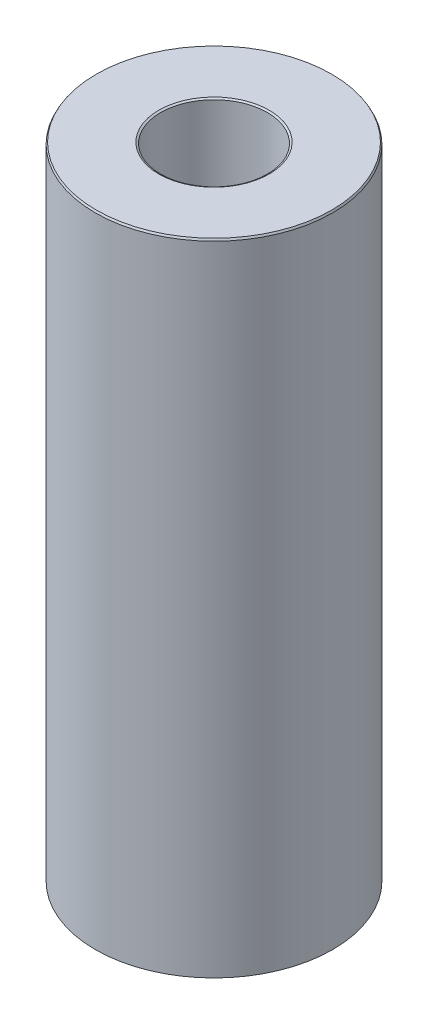
ISO-10303-21;
HEADER;
FILE_DESCRIPTION(('STEP AP214'),'2;1');
FILE_NAME('part.step','',(''),(''),'','','');
FILE_SCHEMA(('AUTOMOTIVE_DESIGN { 1 0 10303 214 1 1 1 1 }'));
ENDSEC;
DATA;
#1=APPLICATION_CONTEXT('core data for automotive mechanical design processes');
#2=APPLICATION_PROTOCOL_DEFINITION('international standard','automotive_design',2000,#1);
#3=PRODUCT_CONTEXT('',#1,'mechanical');
#4=PRODUCT('Part','Part','',(#3));
#5=PRODUCT_RELATED_PRODUCT_CATEGORY('part','',(#4));
#6=PRODUCT_DEFINITION_FORMATION('','',#4);
#7=PRODUCT_DEFINITION_CONTEXT('part definition',#1,'design');
#8=PRODUCT_DEFINITION('design','',#6,#7);
#9=PRODUCT_DEFINITION_SHAPE('','',#8);
#10=(LENGTH_UNIT() NAMED_UNIT(*) SI_UNIT(.MILLI.,.METRE.));
#11=(NAMED_UNIT(*) PLANE_ANGLE_UNIT() SI_UNIT($,.RADIAN.));
#12=(NAMED_UNIT(*) SI_UNIT($,.STERADIAN.) SOLID_ANGLE_UNIT());
#13=UNCERTAINTY_MEASURE_WITH_UNIT(LENGTH_MEASURE(1.E-05),#10,'distance_accuracy_value','');
#14=(GEOMETRIC_REPRESENTATION_CONTEXT(3) GLOBAL_UNCERTAINTY_ASSIGNED_CONTEXT((#13)) GLOBAL_UNIT_ASSIGNED_CONTEXT((#10,
#11,#12)) REPRESENTATION_CONTEXT('',''));
#15=CARTESIAN_POINT('',(0.,0.,0.));
#16=DIRECTION('',(0.,0.,1.));
#17=DIRECTION('',(1.,0.,0.));
#18=AXIS2_PLACEMENT_3D('',#15,#16,#17);
#19=CARTESIAN_POINT('',(0.,161.933538741757,0.));
#20=DIRECTION('',(0.,-1.,0.));
#21=DIRECTION('',(0.,0.,-1.));
#22=AXIS2_PLACEMENT_3D('',#19,#20,#21);
#23=CYLINDRICAL_SURFACE('',#22,30.);
#24=CARTESIAN_POINT('',(0.,0.259017484896457,0.));
#25=DIRECTION('',(0.,1.,0.));
#26=DIRECTION('',(0.,0.,1.));
#27=AXIS2_PLACEMENT_3D('',#24,#25,#26);
#28=CIRCLE('',#27,30.);
#29=CARTESIAN_POINT('',(0.,0.259017484896457,30.));
#30=VERTEX_POINT('',#29);
#31=EDGE_CURVE('E10',#30,#30,#28,.T.);
#32=ORIENTED_EDGE('',*,*,#31,.T.);
#33=EDGE_LOOP('',(#32));
#34=FACE_BOUND('',#33,.T.);
#35=CARTESIAN_POINT('',(0.,161.460937771824,0.));
#36=DIRECTION('',(0.,1.,0.));
#37=DIRECTION('',(0.,0.,1.));
#38=AXIS2_PLACEMENT_3D('',#35,#36,#37);
#39=CIRCLE('',#38,30.);
#40=CARTESIAN_POINT('',(0.,161.460937771824,-30.));
#41=VERTEX_POINT('',#40);
#42=EDGE_CURVE('E50',#41,#41,#39,.F.);
#43=ORIENTED_EDGE('',*,*,#42,.T.);
#44=EDGE_LOOP('',(#43));
#45=FACE_BOUND('',#44,.T.);
#46=ADVANCED_FACE('F39',(#34,#45),#23,.T.);
#47=CARTESIAN_POINT('',(0.,161.933538741757,0.));
#48=DIRECTION('',(0.,1.,0.));
#49=DIRECTION('',(0.,0.,1.));
#50=AXIS2_PLACEMENT_3D('',#47,#48,#49);
#51=PLANE('',#50);
#52=CARTESIAN_POINT('',(0.,161.933538741757,0.));
#53=DIRECTION('',(0.,1.,0.));
#54=DIRECTION('',(0.,0.,1.));
#55=AXIS2_PLACEMENT_3D('',#52,#53,#54);
#56=CIRCLE('',#55,13.9594570714515);
#57=CARTESIAN_POINT('',(0.,161.933538741757,13.9594570714515));
#58=VERTEX_POINT('',#57);
#59=EDGE_CURVE('E58',#58,#58,#56,.F.);
#60=ORIENTED_EDGE('',*,*,#59,.T.);
#61=EDGE_LOOP('',(#60));
#62=FACE_BOUND('',#61,.T.);
#63=CARTESIAN_POINT('',(0.,161.933538741757,0.));
#64=DIRECTION('',(0.,1.,0.));
#65=DIRECTION('',(0.,0.,1.));
#66=AXIS2_PLACEMENT_3D('',#63,#64,#65);
#67=CIRCLE('',#66,29.7409825151036);
#68=CARTESIAN_POINT('',(0.,161.933538741757,-29.7409825151036));
#69=VERTEX_POINT('',#68);
#70=EDGE_CURVE('E61',#69,#69,#67,.T.);
#71=ORIENTED_EDGE('',*,*,#70,.T.);
#72=EDGE_LOOP('',(#71));
#73=FACE_BOUND('',#72,.T.);
#74=ADVANCED_FACE('F88',(#62,#73),#51,.T.);
#75=CARTESIAN_POINT('',(0.,0.,0.));
#76=DIRECTION('',(0.,1.,0.));
#77=DIRECTION('',(0.,0.,1.));
#78=AXIS2_PLACEMENT_3D('',#75,#76,#77);
#79=PLANE('',#78);
#80=CARTESIAN_POINT('',(0.,0.,0.));
#81=DIRECTION('',(0.,1.,0.));
#82=DIRECTION('',(0.,0.,1.));
#83=AXIS2_PLACEMENT_3D('',#80,#81,#82);
#84=CIRCLE('',#83,13.7458735864146);
#85=CARTESIAN_POINT('',(0.,0.,-13.7458735864146));
#86=VERTEX_POINT('',#85);
#87=EDGE_CURVE('E51',#86,#86,#84,.T.);
#88=ORIENTED_EDGE('',*,*,#87,.T.);
#89=EDGE_LOOP('',(#88));
#90=FACE_BOUND('',#89,.T.);
#91=CARTESIAN_POINT('',(0.,0.,0.));
#92=DIRECTION('',(0.,1.,0.));
#93=DIRECTION('',(0.,0.,1.));
#94=AXIS2_PLACEMENT_3D('',#91,#92,#93);
#95=CIRCLE('',#94,29.5273990300666);
#96=CARTESIAN_POINT('',(0.,0.,29.5273990300666));
#97=VERTEX_POINT('',#96);
#98=EDGE_CURVE('E54',#97,#97,#95,.F.);
#99=ORIENTED_EDGE('',*,*,#98,.T.);
#100=EDGE_LOOP('',(#99));
#101=FACE_BOUND('',#100,.T.);
#102=ADVANCED_FACE('F83',(#90,#101),#79,.F.);
#103=CARTESIAN_POINT('',(0.,161.933538741757,0.));
#104=DIRECTION('',(0.,-1.,0.));
#105=DIRECTION('',(0.,0.,-1.));
#106=AXIS2_PLACEMENT_3D('',#103,#104,#105);
#107=CYLINDRICAL_SURFACE('',#106,13.4868561015181);
#108=CARTESIAN_POINT('',(0.,161.67452125686,0.));
#109=DIRECTION('',(0.,1.,0.));
#110=DIRECTION('',(0.,0.,1.));
#111=AXIS2_PLACEMENT_3D('',#108,#109,#110);
#112=CIRCLE('',#111,13.4868561015181);
#113=CARTESIAN_POINT('',(0.,161.67452125686,13.4868561015181));
#114=VERTEX_POINT('',#113);
#115=EDGE_CURVE('E67',#114,#114,#112,.T.);
#116=ORIENTED_EDGE('',*,*,#115,.T.);
#117=EDGE_LOOP('',(#116));
#118=FACE_BOUND('',#117,.T.);
#119=CARTESIAN_POINT('',(0.,0.472600969933429,0.));
#120=DIRECTION('',(0.,1.,0.));
#121=DIRECTION('',(0.,0.,1.));
#122=AXIS2_PLACEMENT_3D('',#119,#120,#121);
#123=CIRCLE('',#122,13.4868561015181);
#124=CARTESIAN_POINT('',(0.,0.472600969933429,-13.4868561015181));
#125=VERTEX_POINT('',#124);
#126=EDGE_CURVE('E69',#125,#125,#123,.F.);
#127=ORIENTED_EDGE('',*,*,#126,.T.);
#128=EDGE_LOOP('',(#127));
#129=FACE_BOUND('',#128,.T.);
#130=ADVANCED_FACE('F71',(#118,#129),#107,.F.);
#131=CARTESIAN_POINT('',(0.,161.67452125686,0.));
#132=DIRECTION('',(0.,1.,0.));
#133=DIRECTION('',(0.,0.,1.));
#134=AXIS2_PLACEMENT_3D('',#131,#132,#133);
#135=CONICAL_SURFACE('',#134,13.4868561015181,1.06943760034883);
#136=ORIENTED_EDGE('',*,*,#59,.F.);
#137=EDGE_LOOP('',(#136));
#138=FACE_BOUND('',#137,.T.);
#139=ORIENTED_EDGE('',*,*,#115,.F.);
#140=EDGE_LOOP('',(#139));
#141=FACE_BOUND('',#140,.T.);
#142=ADVANCED_FACE('F77',(#138,#141),#135,.F.);
#143=CARTESIAN_POINT('',(0.,0.,0.));
#144=DIRECTION('',(0.,-1.,0.));
#145=DIRECTION('',(0.,0.,-1.));
#146=AXIS2_PLACEMENT_3D('',#143,#144,#145);
#147=CONICAL_SURFACE('',#146,13.7458735864146,0.501358726446042);
#148=CARTESIAN_POINT('',(0.,0.472600969933429,-13.4868561015181));
#149=CARTESIAN_POINT('',(0.,0.467678043163289,-13.4895542003191));
#150=CARTESIAN_POINT('',(0.,0.462755116393149,-13.4922522991201));
#151=CARTESIAN_POINT('',(0.,0.452909262852869,-13.4976484967222));
#152=CARTESIAN_POINT('',(0.,0.447986336082729,-13.5003465955232));
#153=CARTESIAN_POINT('',(0.,0.438140482542449,-13.5057427931252));
#154=CARTESIAN_POINT('',(0.,0.43321755577231,-13.5084408919262));
#155=CARTESIAN_POINT('',(0.,0.42337170223203,-13.5138370895282));
#156=CARTESIAN_POINT('',(0.,0.41844877546189,-13.5165351883292));
#157=CARTESIAN_POINT('',(0.,0.40860292192161,-13.5219313859312));
#158=CARTESIAN_POINT('',(0.,0.40367999515147,-13.5246294847322));
#159=CARTESIAN_POINT('',(0.,0.39383414161119,-13.5300256823342));
#160=CARTESIAN_POINT('',(0.,0.388911214841051,-13.5327237811352));
#161=CARTESIAN_POINT('',(0.,0.379065361300771,-13.5381199787372));
#162=CARTESIAN_POINT('',(0.,0.374142434530631,-13.5408180775382));
#163=CARTESIAN_POINT('',(0.,0.364296580990351,-13.5462142751402));
#164=CARTESIAN_POINT('',(0.,0.359373654220212,-13.5489123739412));
#165=CARTESIAN_POINT('',(0.,0.349527800679932,-13.5543085715433));
#166=CARTESIAN_POINT('',(0.,0.344604873909792,-13.5570066703443));
#167=CARTESIAN_POINT('',(0.,0.334759020369512,-13.5624028679463));
#168=CARTESIAN_POINT('',(0.,0.329836093599372,-13.5651009667473));
#169=CARTESIAN_POINT('',(0.,0.319990240059092,-13.5704971643493));
#170=CARTESIAN_POINT('',(0.,0.315067313288953,-13.5731952631503));
#171=CARTESIAN_POINT('',(0.,0.305221459748673,-13.5785914607523));
#172=CARTESIAN_POINT('',(0.,0.300298532978533,-13.5812895595533));
#173=CARTESIAN_POINT('',(0.,0.290452679438253,-13.5866857571553));
#174=CARTESIAN_POINT('',(0.,0.285529752668113,-13.5893838559563));
#175=CARTESIAN_POINT('',(0.,0.275683899127833,-13.5947800535583));
#176=CARTESIAN_POINT('',(0.,0.270760972357694,-13.5974781523593));
#177=CARTESIAN_POINT('',(0.,0.260915118817414,-13.6028743499613));
#178=CARTESIAN_POINT('',(0.,0.255992192047274,-13.6055724487624));
#179=CARTESIAN_POINT('',(0.,0.246146338506994,-13.6109686463644));
#180=CARTESIAN_POINT('',(0.,0.241223411736854,-13.6136667451654));
#181=CARTESIAN_POINT('',(0.,0.231377558196575,-13.6190629427674));
#182=CARTESIAN_POINT('',(0.,0.226454631426435,-13.6217610415684));
#183=CARTESIAN_POINT('',(0.,0.216608777886155,-13.6271572391704));
#184=CARTESIAN_POINT('',(0.,0.211685851116015,-13.6298553379714));
#185=CARTESIAN_POINT('',(0.,0.201839997575735,-13.6352515355734));
#186=CARTESIAN_POINT('',(0.,0.196917070805595,-13.6379496343744));
#187=CARTESIAN_POINT('',(0.,0.187071217265316,-13.6433458319764));
#188=CARTESIAN_POINT('',(0.,0.182148290495176,-13.6460439307774));
#189=CARTESIAN_POINT('',(0.,0.172302436954896,-13.6514401283794));
#190=CARTESIAN_POINT('',(0.,0.167379510184756,-13.6541382271804));
#191=CARTESIAN_POINT('',(0.,0.157533656644476,-13.6595344247824));
#192=CARTESIAN_POINT('',(0.,0.152610729874336,-13.6622325235835));
#193=CARTESIAN_POINT('',(0.,0.142764876334057,-13.6676287211855));
#194=CARTESIAN_POINT('',(0.,0.137841949563917,-13.6703268199865));
#195=CARTESIAN_POINT('',(0.,0.127996096023637,-13.6757230175885));
#196=CARTESIAN_POINT('',(0.,0.123073169253497,-13.6784211163895));
#197=CARTESIAN_POINT('',(0.,0.113227315713217,-13.6838173139915));
#198=CARTESIAN_POINT('',(0.,0.108304388943077,-13.6865154127925));
#199=CARTESIAN_POINT('',(0.,0.0984585354027977,-13.6919116103945));
#200=CARTESIAN_POINT('',(0.,0.0935356086326578,-13.6946097091955));
#201=CARTESIAN_POINT('',(0.,0.083689755092378,-13.7000059067975));
#202=CARTESIAN_POINT('',(0.,0.0787668283222383,-13.7027040055985));
#203=CARTESIAN_POINT('',(0.,0.0689209747819585,-13.7081002032005));
#204=CARTESIAN_POINT('',(0.,0.0639980480118184,-13.7107983020015));
#205=CARTESIAN_POINT('',(0.,0.0541521944715386,-13.7161944996035));
#206=CARTESIAN_POINT('',(0.,0.0492292677013988,-13.7188925984046));
#207=CARTESIAN_POINT('',(0.,0.0393834141611191,-13.7242887960066));
#208=CARTESIAN_POINT('',(0.,0.0344604873909793,-13.7269868948076));
#209=CARTESIAN_POINT('',(0.,0.0246146338506995,-13.7323830924096));
#210=CARTESIAN_POINT('',(0.,0.0196917070805595,-13.7350811912106));
#211=CARTESIAN_POINT('',(0.,0.00984585354027953,-13.7404773888126));
#212=CARTESIAN_POINT('',(0.,0.00492292677013953,-13.7431754876136));
#213=CARTESIAN_POINT('',(0.,0.,-13.7458735864146));
#214=B_SPLINE_CURVE_WITH_KNOTS('',3,(#148,#149,#150,#151,#152,#153,#154,#155,#156,#157,#158,
#159,#160,#161,#162,#163,#164,#165,#166,#167,#168,#169,#170,#171,#172,#173,#174,#175,#176,#177,
#178,#179,#180,#181,#182,#183,#184,#185,#186,#187,#188,#189,#190,#191,#192,#193,#194,#195,#196,
#197,#198,#199,#200,#201,#202,#203,#204,#205,#206,#207,#208,#209,#210,#211,#212,#213),
.UNSPECIFIED.,.F.,.F.,(4,2,2,2,2,2,2,2,2,2,2,2,2,2,2,2,2,2,2,2,2,2,2,2,2,2,2,2,2,2,2,2,4),(0.,
0.0168414520192679,0.033682904038535,0.0505243560578029,0.0673658080770708,0.0842072600963378,
0.101048712115606,0.117890164134874,0.134731616154142,0.151573068173409,0.168414520192677,
0.185255972211944,0.202097424231212,0.218938876250479,0.235780328269747,0.252621780289014,
0.269463232308282,0.28630468432755,0.303146136346817,0.319987588366085,0.336829040385353,
0.35367049240462,0.370511944423888,0.387353396443156,0.404194848462423,0.421036300481691,
0.437877752500959,0.454719204520227,0.471560656539494,0.488402108558762,0.50524356057803,
0.522085012597297,0.538926464616565),.UNSPECIFIED.);
#215=EDGE_CURVE('BSEAM73',#125,#86,#214,.T.);
#216=ORIENTED_EDGE('',*,*,#126,.F.);
#217=ORIENTED_EDGE('',*,*,#87,.F.);
#218=ORIENTED_EDGE('',*,*,#215,.T.);
#219=ORIENTED_EDGE('',*,*,#215,.F.);
#220=EDGE_LOOP('',(#216,#218,#217,#219));
#221=FACE_BOUND('',#220,.T.);
#222=ADVANCED_FACE('F73',(#221),#147,.F.);
#223=CARTESIAN_POINT('',(0.,0.259017484896457,0.));
#224=DIRECTION('',(0.,1.,0.));
#225=DIRECTION('',(0.,0.,1.));
#226=AXIS2_PLACEMENT_3D('',#223,#224,#225);
#227=CONICAL_SURFACE('',#226,30.,1.06943760034885);
#228=ORIENTED_EDGE('',*,*,#98,.F.);
#229=EDGE_LOOP('',(#228));
#230=FACE_BOUND('',#229,.T.);
#231=ORIENTED_EDGE('',*,*,#31,.F.);
#232=EDGE_LOOP('',(#231));
#233=FACE_BOUND('',#232,.T.);
#234=ADVANCED_FACE('F76',(#230,#233),#227,.T.);
#235=CARTESIAN_POINT('',(0.,161.933538741757,0.));
#236=DIRECTION('',(0.,-1.,0.));
#237=DIRECTION('',(0.,0.,-1.));
#238=AXIS2_PLACEMENT_3D('',#235,#236,#237);
#239=CONICAL_SURFACE('',#238,29.7409825151036,0.501358726446054);
#240=CARTESIAN_POINT('',(0.,161.460937771824,-30.));
#241=CARTESIAN_POINT('',(0.,161.465860698594,-29.997301901199));
#242=CARTESIAN_POINT('',(0.,161.470783625364,-29.994603802398));
#243=CARTESIAN_POINT('',(0.,161.480629478904,-29.989207604796));
#244=CARTESIAN_POINT('',(0.,161.485552405674,-29.986509505995));
#245=CARTESIAN_POINT('',(0.,161.495398259215,-29.981113308393));
#246=CARTESIAN_POINT('',(0.,161.500321185985,-29.978415209592));
#247=CARTESIAN_POINT('',(0.,161.510167039525,-29.97301901199));
#248=CARTESIAN_POINT('',(0.,161.515089966295,-29.970320913189));
#249=CARTESIAN_POINT('',(0.,161.524935819835,-29.9649247155869));
#250=CARTESIAN_POINT('',(0.,161.529858746606,-29.9622266167859));
#251=CARTESIAN_POINT('',(0.,161.539704600146,-29.9568304191839));
#252=CARTESIAN_POINT('',(0.,161.544627526916,-29.9541323203829));
#253=CARTESIAN_POINT('',(0.,161.554473380456,-29.9487361227809));
#254=CARTESIAN_POINT('',(0.,161.559396307226,-29.9460380239799));
#255=CARTESIAN_POINT('',(0.,161.569242160767,-29.9406418263779));
#256=CARTESIAN_POINT('',(0.,161.574165087537,-29.9379437275769));
#257=CARTESIAN_POINT('',(0.,161.584010941077,-29.9325475299749));
#258=CARTESIAN_POINT('',(0.,161.588933867847,-29.9298494311739));
#259=CARTESIAN_POINT('',(0.,161.598779721387,-29.9244532335719));
#260=CARTESIAN_POINT('',(0.,161.603702648158,-29.9217551347709));
#261=CARTESIAN_POINT('',(0.,161.613548501698,-29.9163589371689));
#262=CARTESIAN_POINT('',(0.,161.618471428468,-29.9136608383679));
#263=CARTESIAN_POINT('',(0.,161.628317282008,-29.9082646407659));
#264=CARTESIAN_POINT('',(0.,161.633240208778,-29.9055665419649));
#265=CARTESIAN_POINT('',(0.,161.643086062319,-29.9001703443628));
#266=CARTESIAN_POINT('',(0.,161.648008989089,-29.8974722455618));
#267=CARTESIAN_POINT('',(0.,161.657854842629,-29.8920760479598));
#268=CARTESIAN_POINT('',(0.,161.662777769399,-29.8893779491588));
#269=CARTESIAN_POINT('',(0.,161.67262362294,-29.8839817515568));
#270=CARTESIAN_POINT('',(0.,161.67754654971,-29.8812836527558));
#271=CARTESIAN_POINT('',(0.,161.68739240325,-29.8758874551538));
#272=CARTESIAN_POINT('',(0.,161.69231533002,-29.8731893563528));
#273=CARTESIAN_POINT('',(0.,161.70216118356,-29.8677931587508));
#274=CARTESIAN_POINT('',(0.,161.707084110331,-29.8650950599498));
#275=CARTESIAN_POINT('',(0.,161.716929963871,-29.8596988623478));
#276=CARTESIAN_POINT('',(0.,161.721852890641,-29.8570007635468));
#277=CARTESIAN_POINT('',(0.,161.731698744181,-29.8516045659448));
#278=CARTESIAN_POINT('',(0.,161.736621670951,-29.8489064671438));
#279=CARTESIAN_POINT('',(0.,161.746467524492,-29.8435102695417));
#280=CARTESIAN_POINT('',(0.,161.751390451262,-29.8408121707407));
#281=CARTESIAN_POINT('',(0.,161.761236304802,-29.8354159731387));
#282=CARTESIAN_POINT('',(0.,161.766159231572,-29.8327178743377));
#283=CARTESIAN_POINT('',(0.,161.776005085113,-29.8273216767357));
#284=CARTESIAN_POINT('',(0.,161.780928011883,-29.8246235779347));
#285=CARTESIAN_POINT('',(0.,161.790773865423,-29.8192273803327));
#286=CARTESIAN_POINT('',(0.,161.795696792193,-29.8165292815317));
#287=CARTESIAN_POINT('',(0.,161.805542645733,-29.8111330839297));
#288=CARTESIAN_POINT('',(0.,161.810465572503,-29.8084349851287));
#289=CARTESIAN_POINT('',(0.,161.820311426044,-29.8030387875267));
#290=CARTESIAN_POINT('',(0.,161.825234352814,-29.8003406887257));
#291=CARTESIAN_POINT('',(0.,161.835080206354,-29.7949444911237));
#292=CARTESIAN_POINT('',(0.,161.840003133124,-29.7922463923227));
#293=CARTESIAN_POINT('',(0.,161.849848986665,-29.7868501947206));
#294=CARTESIAN_POINT('',(0.,161.854771913435,-29.7841520959196));
#295=CARTESIAN_POINT('',(0.,161.864617766975,-29.7787558983176));
#296=CARTESIAN_POINT('',(0.,161.869540693745,-29.7760577995166));
#297=CARTESIAN_POINT('',(0.,161.879386547285,-29.7706616019146));
#298=CARTESIAN_POINT('',(0.,161.884309474056,-29.7679635031136));
#299=CARTESIAN_POINT('',(0.,161.894155327596,-29.7625673055116));
#300=CARTESIAN_POINT('',(0.,161.899078254366,-29.7598692067106));
#301=CARTESIAN_POINT('',(0.,161.908924107906,-29.7544730091086));
#302=CARTESIAN_POINT('',(0.,161.913847034676,-29.7517749103076));
#303=CARTESIAN_POINT('',(0.,161.923692888217,-29.7463787127056));
#304=CARTESIAN_POINT('',(0.,161.928615814987,-29.7436806139046));
#305=CARTESIAN_POINT('',(0.,161.933538741757,-29.7409825151036));
#306=B_SPLINE_CURVE_WITH_KNOTS('',3,(#240,#241,#242,#243,#244,#245,#246,#247,#248,#249,#250,
#251,#252,#253,#254,#255,#256,#257,#258,#259,#260,#261,#262,#263,#264,#265,#266,#267,#268,#269,
#270,#271,#272,#273,#274,#275,#276,#277,#278,#279,#280,#281,#282,#283,#284,#285,#286,#287,#288,
#289,#290,#291,#292,#293,#294,#295,#296,#297,#298,#299,#300,#301,#302,#303,#304,#305),
.UNSPECIFIED.,.F.,.F.,(4,2,2,2,2,2,2,2,2,2,2,2,2,2,2,2,2,2,2,2,2,2,2,2,2,2,2,2,2,2,2,2,4),(0.,
0.0168414520192481,0.0336829040385204,0.0505243560577928,0.0673658080770409,0.0842072600963133,
0.101048712115586,0.117890164134834,0.134731616154106,0.151573068173379,0.168414520192627,
0.185255972211899,0.202097424231171,0.218938876250419,0.235780328269692,0.252621780288964,
0.269463232308237,0.286304684327485,0.303146136346757,0.31998758836603,0.336829040385278,
0.35367049240455,0.370511944423822,0.38735339644307,0.404194848462343,0.421036300481615,
0.437877752500863,0.454719204520136,0.471560656539408,0.488402108558656,0.505243560577929,
0.522085012597201,0.538926464616473),.UNSPECIFIED.);
#307=EDGE_CURVE('BSEAM45',#41,#69,#306,.T.);
#308=ORIENTED_EDGE('',*,*,#42,.F.);
#309=ORIENTED_EDGE('',*,*,#70,.F.);
#310=ORIENTED_EDGE('',*,*,#307,.T.);
#311=ORIENTED_EDGE('',*,*,#307,.F.);
#312=EDGE_LOOP('',(#308,#310,#309,#311));
#313=FACE_BOUND('',#312,.T.);
#314=ADVANCED_FACE('F45',(#313),#239,.T.);
#315=CLOSED_SHELL('',(#46,#74,#102,#130,#142,#222,#234,#314));
#316=MANIFOLD_SOLID_BREP('B2',#315);
#317=ADVANCED_BREP_SHAPE_REPRESENTATION('',(#18,#316),#14);
#318=SHAPE_DEFINITION_REPRESENTATION(#9,#317);
ENDSEC;
END-ISO-10303-21;
